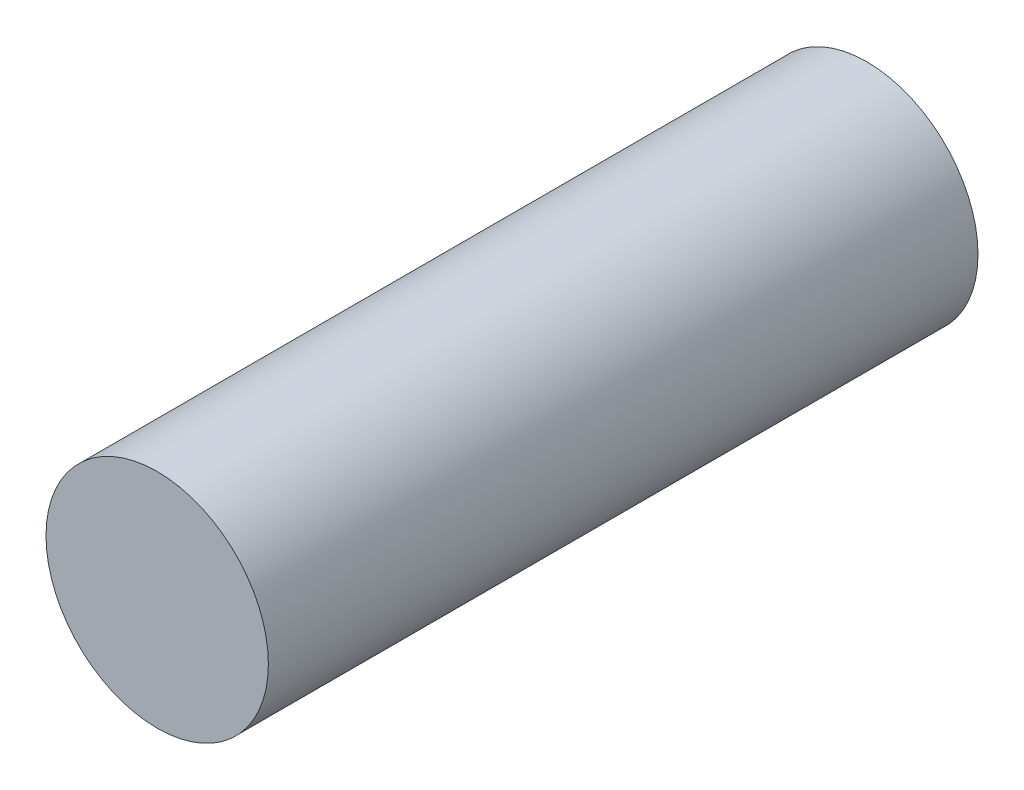
ISO-10303-21;
HEADER;
FILE_DESCRIPTION(('STEP AP214'),'2;1');
FILE_NAME('part.step','',(''),(''),'','','');
FILE_SCHEMA(('AUTOMOTIVE_DESIGN { 1 0 10303 214 1 1 1 1 }'));
ENDSEC;
DATA;
#1=APPLICATION_CONTEXT('core data for automotive mechanical design processes');
#2=APPLICATION_PROTOCOL_DEFINITION('international standard','automotive_design',2000,#1);
#3=PRODUCT_CONTEXT('',#1,'mechanical');
#4=PRODUCT('Part','Part','',(#3));
#5=PRODUCT_RELATED_PRODUCT_CATEGORY('part','',(#4));
#6=PRODUCT_DEFINITION_FORMATION('','',#4);
#7=PRODUCT_DEFINITION_CONTEXT('part definition',#1,'design');
#8=PRODUCT_DEFINITION('design','',#6,#7);
#9=PRODUCT_DEFINITION_SHAPE('','',#8);
#10=(LENGTH_UNIT() NAMED_UNIT(*) SI_UNIT(.MILLI.,.METRE.));
#11=(NAMED_UNIT(*) PLANE_ANGLE_UNIT() SI_UNIT($,.RADIAN.));
#12=(NAMED_UNIT(*) SI_UNIT($,.STERADIAN.) SOLID_ANGLE_UNIT());
#13=UNCERTAINTY_MEASURE_WITH_UNIT(LENGTH_MEASURE(1.E-05),#10,'distance_accuracy_value','');
#14=(GEOMETRIC_REPRESENTATION_CONTEXT(3) GLOBAL_UNCERTAINTY_ASSIGNED_CONTEXT((#13)) GLOBAL_UNIT_ASSIGNED_CONTEXT((#10,
#11,#12)) REPRESENTATION_CONTEXT('',''));
#15=CARTESIAN_POINT('',(0.,0.,0.));
#16=DIRECTION('',(0.,0.,1.));
#17=DIRECTION('',(1.,0.,0.));
#18=AXIS2_PLACEMENT_3D('',#15,#16,#17);
#19=CARTESIAN_POINT('',(0.,0.,100.));
#20=DIRECTION('',(0.,0.,-1.));
#21=DIRECTION('',(-1.,0.,0.));
#22=AXIS2_PLACEMENT_3D('',#19,#20,#21);
#23=CYLINDRICAL_SURFACE('',#22,15.6683310205872);
#24=CARTESIAN_POINT('',(0.,0.,100.));
#25=DIRECTION('',(0.,0.,1.));
#26=DIRECTION('',(1.,0.,0.));
#27=AXIS2_PLACEMENT_3D('',#24,#25,#26);
#28=CIRCLE('',#27,15.6683310205872);
#29=CARTESIAN_POINT('',(15.6683310205872,0.,100.));
#30=VERTEX_POINT('',#29);
#31=EDGE_CURVE('E10',#30,#30,#28,.T.);
#32=ORIENTED_EDGE('',*,*,#31,.F.);
#33=EDGE_LOOP('',(#32));
#34=FACE_BOUND('',#33,.T.);
#35=CARTESIAN_POINT('',(0.,0.,0.));
#36=DIRECTION('',(0.,0.,1.));
#37=DIRECTION('',(1.,0.,0.));
#38=AXIS2_PLACEMENT_3D('',#35,#36,#37);
#39=CIRCLE('',#38,15.6683310205872);
#40=CARTESIAN_POINT('',(15.6683310205872,0.,0.));
#41=VERTEX_POINT('',#40);
#42=EDGE_CURVE('E36',#41,#41,#39,.T.);
#43=ORIENTED_EDGE('',*,*,#42,.T.);
#44=EDGE_LOOP('',(#43));
#45=FACE_BOUND('',#44,.T.);
#46=ADVANCED_FACE('F33',(#34,#45),#23,.T.);
#47=CARTESIAN_POINT('',(0.,0.,100.));
#48=DIRECTION('',(0.,0.,1.));
#49=DIRECTION('',(1.,0.,0.));
#50=AXIS2_PLACEMENT_3D('',#47,#48,#49);
#51=PLANE('',#50);
#52=ORIENTED_EDGE('',*,*,#31,.T.);
#53=EDGE_LOOP('',(#52));
#54=FACE_BOUND('',#53,.T.);
#55=ADVANCED_FACE('F48',(#54),#51,.T.);
#56=CARTESIAN_POINT('',(0.,0.,0.));
#57=DIRECTION('',(0.,0.,1.));
#58=DIRECTION('',(1.,0.,0.));
#59=AXIS2_PLACEMENT_3D('',#56,#57,#58);
#60=PLANE('',#59);
#61=ORIENTED_EDGE('',*,*,#42,.F.);
#62=EDGE_LOOP('',(#61));
#63=FACE_BOUND('',#62,.T.);
#64=ADVANCED_FACE('F46',(#63),#60,.F.);
#65=CLOSED_SHELL('',(#46,#55,#64));
#66=MANIFOLD_SOLID_BREP('B2',#65);
#67=ADVANCED_BREP_SHAPE_REPRESENTATION('',(#18,#66),#14);
#68=SHAPE_DEFINITION_REPRESENTATION(#9,#67);
ENDSEC;
END-ISO-10303-21;
